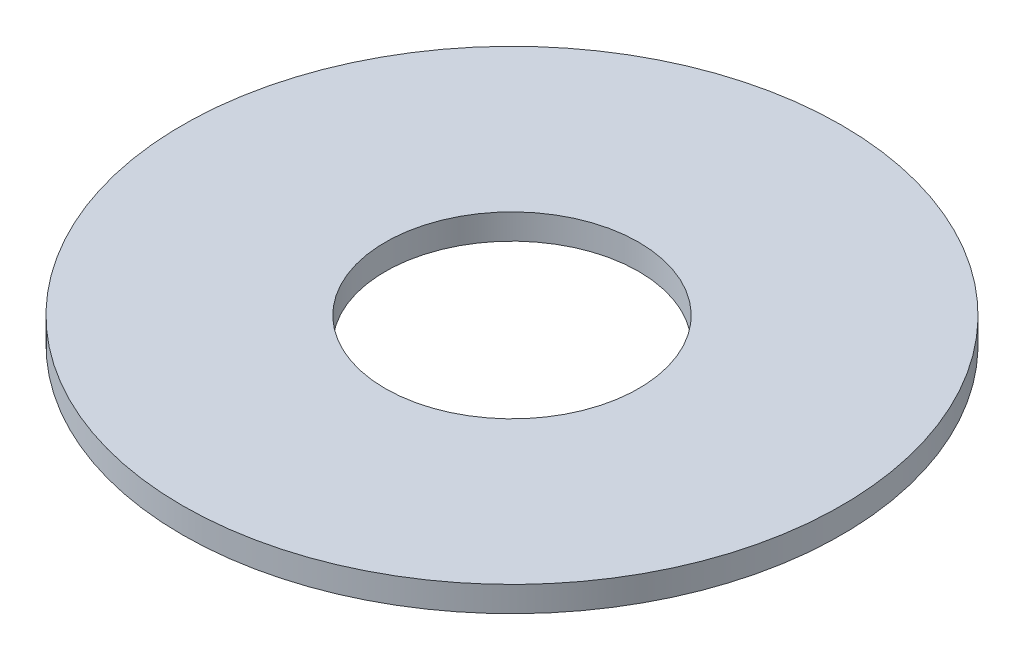
ISO-10303-21;
HEADER;
FILE_DESCRIPTION(('STEP AP214'),'2;1');
FILE_NAME('part.step','',(''),(''),'','','');
FILE_SCHEMA(('AUTOMOTIVE_DESIGN { 1 0 10303 214 1 1 1 1 }'));
ENDSEC;
DATA;
#1=APPLICATION_CONTEXT('core data for automotive mechanical design processes');
#2=APPLICATION_PROTOCOL_DEFINITION('international standard','automotive_design',2000,#1);
#3=PRODUCT_CONTEXT('',#1,'mechanical');
#4=PRODUCT('Part','Part','',(#3));
#5=PRODUCT_RELATED_PRODUCT_CATEGORY('part','',(#4));
#6=PRODUCT_DEFINITION_FORMATION('','',#4);
#7=PRODUCT_DEFINITION_CONTEXT('part definition',#1,'design');
#8=PRODUCT_DEFINITION('design','',#6,#7);
#9=PRODUCT_DEFINITION_SHAPE('','',#8);
#10=(LENGTH_UNIT() NAMED_UNIT(*) SI_UNIT(.MILLI.,.METRE.));
#11=(NAMED_UNIT(*) PLANE_ANGLE_UNIT() SI_UNIT($,.RADIAN.));
#12=(NAMED_UNIT(*) SI_UNIT($,.STERADIAN.) SOLID_ANGLE_UNIT());
#13=UNCERTAINTY_MEASURE_WITH_UNIT(LENGTH_MEASURE(1.E-05),#10,'distance_accuracy_value','');
#14=(GEOMETRIC_REPRESENTATION_CONTEXT(3) GLOBAL_UNCERTAINTY_ASSIGNED_CONTEXT((#13)) GLOBAL_UNIT_ASSIGNED_CONTEXT((#10,
#11,#12)) REPRESENTATION_CONTEXT('',''));
#15=CARTESIAN_POINT('',(0.,0.,0.));
#16=DIRECTION('',(0.,0.,1.));
#17=DIRECTION('',(1.,0.,0.));
#18=AXIS2_PLACEMENT_3D('',#15,#16,#17);
#19=CARTESIAN_POINT('',(0.,3.175,0.));
#20=DIRECTION('',(0.,1.,0.));
#21=DIRECTION('',(0.,0.,1.));
#22=AXIS2_PLACEMENT_3D('',#19,#20,#21);
#23=PLANE('',#22);
#24=CARTESIAN_POINT('',(0.,3.175,0.));
#25=DIRECTION('',(0.,1.,0.));
#26=DIRECTION('',(0.,0.,1.));
#27=AXIS2_PLACEMENT_3D('',#24,#25,#26);
#28=CIRCLE('',#27,41.275);
#29=CARTESIAN_POINT('',(0.,3.175,41.275));
#30=VERTEX_POINT('',#29);
#31=EDGE_CURVE('E10',#30,#30,#28,.T.);
#32=ORIENTED_EDGE('',*,*,#31,.T.);
#33=EDGE_LOOP('',(#32));
#34=FACE_BOUND('',#33,.T.);
#35=CARTESIAN_POINT('',(0.,3.175,0.));
#36=DIRECTION('',(0.,1.,0.));
#37=DIRECTION('',(0.,0.,1.));
#38=AXIS2_PLACEMENT_3D('',#35,#36,#37);
#39=CIRCLE('',#38,15.875);
#40=CARTESIAN_POINT('',(0.,3.175,15.875));
#41=VERTEX_POINT('',#40);
#42=EDGE_CURVE('E42',#41,#41,#39,.T.);
#43=ORIENTED_EDGE('',*,*,#42,.F.);
#44=EDGE_LOOP('',(#43));
#45=FACE_BOUND('',#44,.T.);
#46=ADVANCED_FACE('F31',(#34,#45),#23,.T.);
#47=CARTESIAN_POINT('',(0.,0.,0.));
#48=DIRECTION('',(0.,1.,0.));
#49=DIRECTION('',(0.,0.,1.));
#50=AXIS2_PLACEMENT_3D('',#47,#48,#49);
#51=PLANE('',#50);
#52=CARTESIAN_POINT('',(0.,0.,0.));
#53=DIRECTION('',(0.,1.,0.));
#54=DIRECTION('',(0.,0.,1.));
#55=AXIS2_PLACEMENT_3D('',#52,#53,#54);
#56=CIRCLE('',#55,41.275);
#57=CARTESIAN_POINT('',(0.,0.,41.275));
#58=VERTEX_POINT('',#57);
#59=EDGE_CURVE('E35',#58,#58,#56,.T.);
#60=ORIENTED_EDGE('',*,*,#59,.F.);
#61=EDGE_LOOP('',(#60));
#62=FACE_BOUND('',#61,.T.);
#63=CARTESIAN_POINT('',(0.,0.,0.));
#64=DIRECTION('',(0.,1.,0.));
#65=DIRECTION('',(0.,0.,1.));
#66=AXIS2_PLACEMENT_3D('',#63,#64,#65);
#67=CIRCLE('',#66,15.875);
#68=CARTESIAN_POINT('',(0.,0.,15.875));
#69=VERTEX_POINT('',#68);
#70=EDGE_CURVE('E44',#69,#69,#67,.T.);
#71=ORIENTED_EDGE('',*,*,#70,.T.);
#72=EDGE_LOOP('',(#71));
#73=FACE_BOUND('',#72,.T.);
#74=ADVANCED_FACE('F54',(#62,#73),#51,.F.);
#75=CARTESIAN_POINT('',(0.,3.175,0.));
#76=DIRECTION('',(0.,-1.,0.));
#77=DIRECTION('',(0.,0.,-1.));
#78=AXIS2_PLACEMENT_3D('',#75,#76,#77);
#79=CYLINDRICAL_SURFACE('',#78,41.275);
#80=ORIENTED_EDGE('',*,*,#31,.F.);
#81=EDGE_LOOP('',(#80));
#82=FACE_BOUND('',#81,.T.);
#83=ORIENTED_EDGE('',*,*,#59,.T.);
#84=EDGE_LOOP('',(#83));
#85=FACE_BOUND('',#84,.T.);
#86=ADVANCED_FACE('F33',(#82,#85),#79,.T.);
#87=CARTESIAN_POINT('',(0.,3.175,0.));
#88=DIRECTION('',(0.,-1.,0.));
#89=DIRECTION('',(0.,0.,-1.));
#90=AXIS2_PLACEMENT_3D('',#87,#88,#89);
#91=CYLINDRICAL_SURFACE('',#90,15.875);
#92=ORIENTED_EDGE('',*,*,#42,.T.);
#93=EDGE_LOOP('',(#92));
#94=FACE_BOUND('',#93,.T.);
#95=ORIENTED_EDGE('',*,*,#70,.F.);
#96=EDGE_LOOP('',(#95));
#97=FACE_BOUND('',#96,.T.);
#98=ADVANCED_FACE('F50',(#94,#97),#91,.F.);
#99=CLOSED_SHELL('',(#46,#74,#86,#98));
#100=MANIFOLD_SOLID_BREP('B2',#99);
#101=ADVANCED_BREP_SHAPE_REPRESENTATION('',(#18,#100),#14);
#102=SHAPE_DEFINITION_REPRESENTATION(#9,#101);
ENDSEC;
END-ISO-10303-21;
